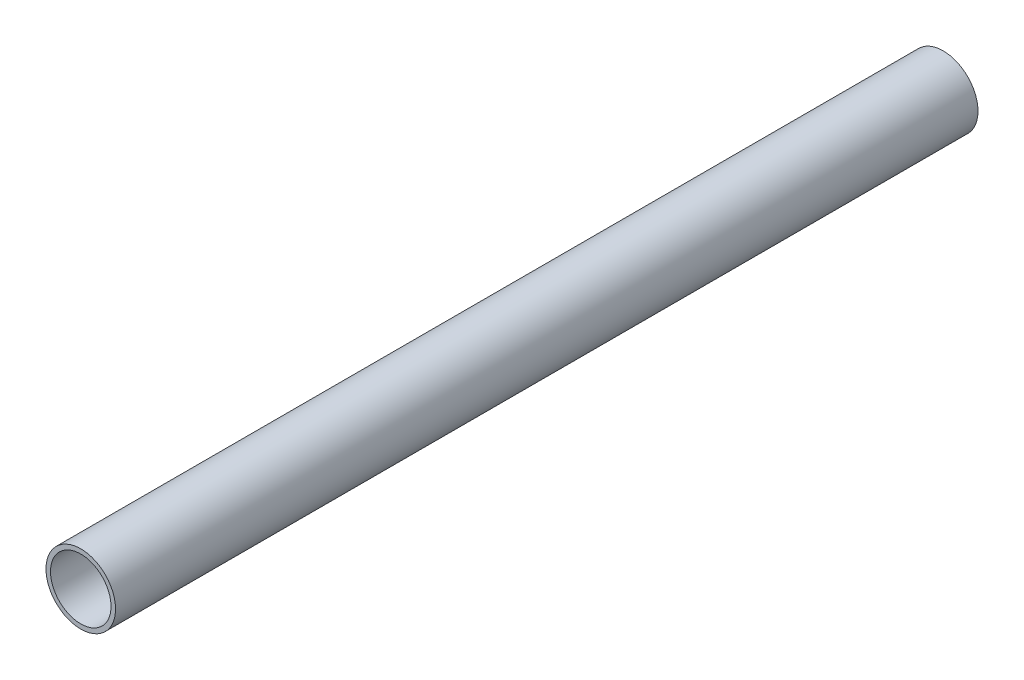
ISO-10303-21;
HEADER;
FILE_DESCRIPTION(('STEP AP214'),'2;1');
FILE_NAME('part.step','',(''),(''),'','','');
FILE_SCHEMA(('AUTOMOTIVE_DESIGN { 1 0 10303 214 1 1 1 1 }'));
ENDSEC;
DATA;
#1=APPLICATION_CONTEXT('core data for automotive mechanical design processes');
#2=APPLICATION_PROTOCOL_DEFINITION('international standard','automotive_design',2000,#1);
#3=PRODUCT_CONTEXT('',#1,'mechanical');
#4=PRODUCT('Part','Part','',(#3));
#5=PRODUCT_RELATED_PRODUCT_CATEGORY('part','',(#4));
#6=PRODUCT_DEFINITION_FORMATION('','',#4);
#7=PRODUCT_DEFINITION_CONTEXT('part definition',#1,'design');
#8=PRODUCT_DEFINITION('design','',#6,#7);
#9=PRODUCT_DEFINITION_SHAPE('','',#8);
#10=(LENGTH_UNIT() NAMED_UNIT(*) SI_UNIT(.MILLI.,.METRE.));
#11=(NAMED_UNIT(*) PLANE_ANGLE_UNIT() SI_UNIT($,.RADIAN.));
#12=(NAMED_UNIT(*) SI_UNIT($,.STERADIAN.) SOLID_ANGLE_UNIT());
#13=UNCERTAINTY_MEASURE_WITH_UNIT(LENGTH_MEASURE(1.E-05),#10,'distance_accuracy_value','');
#14=(GEOMETRIC_REPRESENTATION_CONTEXT(3) GLOBAL_UNCERTAINTY_ASSIGNED_CONTEXT((#13)) GLOBAL_UNIT_ASSIGNED_CONTEXT((#10,
#11,#12)) REPRESENTATION_CONTEXT('',''));
#15=CARTESIAN_POINT('',(0.,0.,0.));
#16=DIRECTION('',(0.,0.,1.));
#17=DIRECTION('',(1.,0.,0.));
#18=AXIS2_PLACEMENT_3D('',#15,#16,#17);
#19=CARTESIAN_POINT('',(0.,3.33066907387547E-13,833.215583248056));
#20=DIRECTION('',(0.,0.,-1.));
#21=DIRECTION('',(-1.,0.,0.));
#22=AXIS2_PLACEMENT_3D('',#19,#20,#21);
#23=CYLINDRICAL_SURFACE('',#22,30.1625);
#24=CARTESIAN_POINT('',(0.,0.,0.));
#25=DIRECTION('',(0.,0.,1.));
#26=DIRECTION('',(1.,0.,0.));
#27=AXIS2_PLACEMENT_3D('',#24,#25,#26);
#28=CIRCLE('',#27,30.1625);
#29=CARTESIAN_POINT('',(30.1625,0.,0.));
#30=VERTEX_POINT('',#29);
#31=EDGE_CURVE('E36',#30,#30,#28,.T.);
#32=ORIENTED_EDGE('',*,*,#31,.T.);
#33=EDGE_LOOP('',(#32));
#34=FACE_BOUND('',#33,.T.);
#35=CARTESIAN_POINT('',(0.,0.,747.903150097897));
#36=DIRECTION('',(0.,0.,1.));
#37=DIRECTION('',(0.,-1.,0.));
#38=AXIS2_PLACEMENT_3D('',#35,#36,#37);
#39=CIRCLE('',#38,30.1625);
#40=CARTESIAN_POINT('',(0.,-30.1625,747.903150097897));
#41=VERTEX_POINT('',#40);
#42=EDGE_CURVE('E10',#41,#41,#39,.T.);
#43=ORIENTED_EDGE('',*,*,#42,.F.);
#44=EDGE_LOOP('',(#43));
#45=FACE_BOUND('',#44,.T.);
#46=ADVANCED_FACE('F29',(#34,#45),#23,.T.);
#47=CARTESIAN_POINT('',(0.,0.,0.));
#48=DIRECTION('',(0.,0.,1.));
#49=DIRECTION('',(1.,0.,0.));
#50=AXIS2_PLACEMENT_3D('',#47,#48,#49);
#51=PLANE('',#50);
#52=ORIENTED_EDGE('',*,*,#31,.F.);
#53=EDGE_LOOP('',(#52));
#54=FACE_BOUND('',#53,.T.);
#55=CARTESIAN_POINT('',(0.,0.,0.));
#56=DIRECTION('',(0.,0.,1.));
#57=DIRECTION('',(1.,0.,0.));
#58=AXIS2_PLACEMENT_3D('',#55,#56,#57);
#59=CIRCLE('',#58,26.2509);
#60=CARTESIAN_POINT('',(26.2509,0.,0.));
#61=VERTEX_POINT('',#60);
#62=EDGE_CURVE('E41',#61,#61,#59,.T.);
#63=ORIENTED_EDGE('',*,*,#62,.T.);
#64=EDGE_LOOP('',(#63));
#65=FACE_BOUND('',#64,.T.);
#66=ADVANCED_FACE('F57',(#54,#65),#51,.F.);
#67=CARTESIAN_POINT('',(0.,3.33066907387547E-13,833.215583248056));
#68=DIRECTION('',(0.,0.,-1.));
#69=DIRECTION('',(-1.,0.,0.));
#70=AXIS2_PLACEMENT_3D('',#67,#68,#69);
#71=CYLINDRICAL_SURFACE('',#70,26.2509);
#72=ORIENTED_EDGE('',*,*,#62,.F.);
#73=EDGE_LOOP('',(#72));
#74=FACE_BOUND('',#73,.T.);
#75=CARTESIAN_POINT('',(0.,0.,747.903150097897));
#76=DIRECTION('',(0.,0.,1.));
#77=DIRECTION('',(0.,-1.,0.));
#78=AXIS2_PLACEMENT_3D('',#75,#76,#77);
#79=CIRCLE('',#78,26.2509);
#80=CARTESIAN_POINT('',(0.,-26.2509,747.903150097897));
#81=VERTEX_POINT('',#80);
#82=EDGE_CURVE('E32',#81,#81,#79,.T.);
#83=ORIENTED_EDGE('',*,*,#82,.T.);
#84=EDGE_LOOP('',(#83));
#85=FACE_BOUND('',#84,.T.);
#86=ADVANCED_FACE('F49',(#74,#85),#71,.F.);
#87=CARTESIAN_POINT('',(72.0249999970015,-77.7878621136079,747.903150097898));
#88=DIRECTION('',(0.,0.,1.));
#89=DIRECTION('',(0.,1.,0.));
#90=AXIS2_PLACEMENT_3D('',#87,#88,#89);
#91=PLANE('',#90);
#92=ORIENTED_EDGE('',*,*,#82,.F.);
#93=EDGE_LOOP('',(#92));
#94=FACE_BOUND('',#93,.T.);
#95=ORIENTED_EDGE('',*,*,#42,.T.);
#96=EDGE_LOOP('',(#95));
#97=FACE_BOUND('',#96,.T.);
#98=ADVANCED_FACE('F51',(#94,#97),#91,.T.);
#99=CLOSED_SHELL('',(#46,#66,#86,#98));
#100=MANIFOLD_SOLID_BREP('B2',#99);
#101=ADVANCED_BREP_SHAPE_REPRESENTATION('',(#18,#100),#14);
#102=SHAPE_DEFINITION_REPRESENTATION(#9,#101);
ENDSEC;
END-ISO-10303-21;
